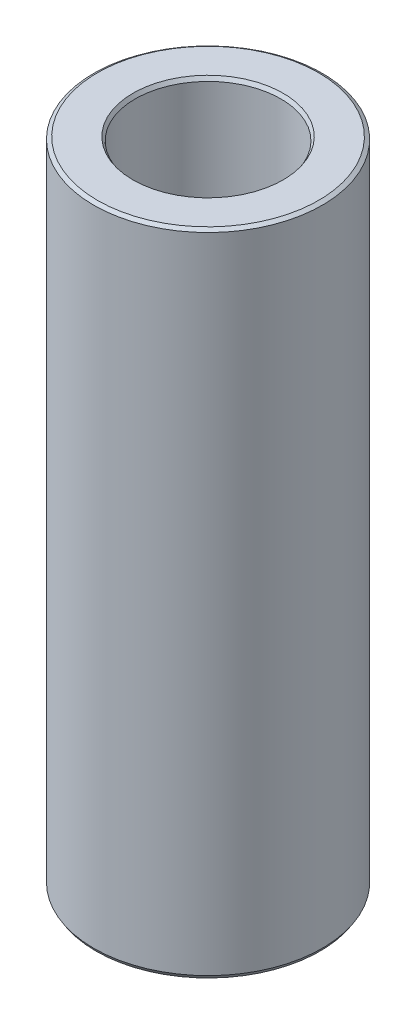
ISO-10303-21;
HEADER;
FILE_DESCRIPTION(('STEP AP214'),'2;1');
FILE_NAME('part.step','',(''),(''),'','','');
FILE_SCHEMA(('AUTOMOTIVE_DESIGN { 1 0 10303 214 1 1 1 1 }'));
ENDSEC;
DATA;
#1=APPLICATION_CONTEXT('core data for automotive mechanical design processes');
#2=APPLICATION_PROTOCOL_DEFINITION('international standard','automotive_design',2000,#1);
#3=PRODUCT_CONTEXT('',#1,'mechanical');
#4=PRODUCT('Part','Part','',(#3));
#5=PRODUCT_RELATED_PRODUCT_CATEGORY('part','',(#4));
#6=PRODUCT_DEFINITION_FORMATION('','',#4);
#7=PRODUCT_DEFINITION_CONTEXT('part definition',#1,'design');
#8=PRODUCT_DEFINITION('design','',#6,#7);
#9=PRODUCT_DEFINITION_SHAPE('','',#8);
#10=(LENGTH_UNIT() NAMED_UNIT(*) SI_UNIT(.MILLI.,.METRE.));
#11=(NAMED_UNIT(*) PLANE_ANGLE_UNIT() SI_UNIT($,.RADIAN.));
#12=(NAMED_UNIT(*) SI_UNIT($,.STERADIAN.) SOLID_ANGLE_UNIT());
#13=UNCERTAINTY_MEASURE_WITH_UNIT(LENGTH_MEASURE(1.E-05),#10,'distance_accuracy_value','');
#14=(GEOMETRIC_REPRESENTATION_CONTEXT(3) GLOBAL_UNCERTAINTY_ASSIGNED_CONTEXT((#13)) GLOBAL_UNIT_ASSIGNED_CONTEXT((#10,
#11,#12)) REPRESENTATION_CONTEXT('',''));
#15=CARTESIAN_POINT('',(0.,0.,0.));
#16=DIRECTION('',(0.,0.,1.));
#17=DIRECTION('',(1.,0.,0.));
#18=AXIS2_PLACEMENT_3D('',#15,#16,#17);
#19=CARTESIAN_POINT('',(0.,127.889407203139,0.));
#20=DIRECTION('',(0.,-1.,0.));
#21=DIRECTION('',(0.,0.,-1.));
#22=AXIS2_PLACEMENT_3D('',#19,#20,#21);
#23=CYLINDRICAL_SURFACE('',#22,22.5);
#24=CARTESIAN_POINT('',(0.,0.729408993619535,0.));
#25=DIRECTION('',(0.,1.,0.));
#26=DIRECTION('',(0.,0.,1.));
#27=AXIS2_PLACEMENT_3D('',#24,#25,#26);
#28=CIRCLE('',#27,22.5);
#29=CARTESIAN_POINT('',(0.,0.729408993619535,22.5));
#30=VERTEX_POINT('',#29);
#31=EDGE_CURVE('E10',#30,#30,#28,.T.);
#32=ORIENTED_EDGE('',*,*,#31,.T.);
#33=EDGE_LOOP('',(#32));
#34=FACE_BOUND('',#33,.T.);
#35=CARTESIAN_POINT('',(0.,127.431217327372,0.));
#36=DIRECTION('',(0.,1.,0.));
#37=DIRECTION('',(0.,0.,1.));
#38=AXIS2_PLACEMENT_3D('',#35,#36,#37);
#39=CIRCLE('',#38,22.5);
#40=CARTESIAN_POINT('',(0.,127.431217327372,22.5));
#41=VERTEX_POINT('',#40);
#42=EDGE_CURVE('E50',#41,#41,#39,.F.);
#43=ORIENTED_EDGE('',*,*,#42,.T.);
#44=EDGE_LOOP('',(#43));
#45=FACE_BOUND('',#44,.T.);
#46=ADVANCED_FACE('F39',(#34,#45),#23,.T.);
#47=CARTESIAN_POINT('',(0.,127.889407203139,0.));
#48=DIRECTION('',(0.,1.,0.));
#49=DIRECTION('',(0.,0.,1.));
#50=AXIS2_PLACEMENT_3D('',#47,#48,#49);
#51=PLANE('',#50);
#52=CARTESIAN_POINT('',(0.,127.889407203139,0.));
#53=DIRECTION('',(0.,1.,0.));
#54=DIRECTION('',(0.,0.,1.));
#55=AXIS2_PLACEMENT_3D('',#52,#53,#54);
#56=CIRCLE('',#55,14.7904141828817);
#57=CARTESIAN_POINT('',(0.,127.889407203139,14.7904141828817));
#58=VERTEX_POINT('',#57);
#59=EDGE_CURVE('E58',#58,#58,#56,.F.);
#60=ORIENTED_EDGE('',*,*,#59,.T.);
#61=EDGE_LOOP('',(#60));
#62=FACE_BOUND('',#61,.T.);
#63=CARTESIAN_POINT('',(0.,127.889407203139,0.));
#64=DIRECTION('',(0.,1.,0.));
#65=DIRECTION('',(0.,0.,1.));
#66=AXIS2_PLACEMENT_3D('',#63,#64,#65);
#67=CIRCLE('',#66,21.7705910063805);
#68=CARTESIAN_POINT('',(0.,127.889407203139,21.7705910063805));
#69=VERTEX_POINT('',#68);
#70=EDGE_CURVE('E61',#69,#69,#67,.T.);
#71=ORIENTED_EDGE('',*,*,#70,.T.);
#72=EDGE_LOOP('',(#71));
#73=FACE_BOUND('',#72,.T.);
#74=ADVANCED_FACE('F88',(#62,#73),#51,.T.);
#75=CARTESIAN_POINT('',(0.,0.,0.));
#76=DIRECTION('',(0.,1.,0.));
#77=DIRECTION('',(0.,0.,1.));
#78=AXIS2_PLACEMENT_3D('',#75,#76,#77);
#79=PLANE('',#78);
#80=CARTESIAN_POINT('',(0.,0.,0.));
#81=DIRECTION('',(0.,1.,0.));
#82=DIRECTION('',(0.,0.,1.));
#83=AXIS2_PLACEMENT_3D('',#80,#81,#82);
#84=CIRCLE('',#83,15.061633300734);
#85=CARTESIAN_POINT('',(0.,0.,15.061633300734));
#86=VERTEX_POINT('',#85);
#87=EDGE_CURVE('E51',#86,#86,#84,.T.);
#88=ORIENTED_EDGE('',*,*,#87,.T.);
#89=EDGE_LOOP('',(#88));
#90=FACE_BOUND('',#89,.T.);
#91=CARTESIAN_POINT('',(0.,0.,0.));
#92=DIRECTION('',(0.,1.,0.));
#93=DIRECTION('',(0.,0.,1.));
#94=AXIS2_PLACEMENT_3D('',#91,#92,#93);
#95=CIRCLE('',#94,22.0418101242327);
#96=CARTESIAN_POINT('',(0.,0.,22.0418101242327));
#97=VERTEX_POINT('',#96);
#98=EDGE_CURVE('E54',#97,#97,#95,.F.);
#99=ORIENTED_EDGE('',*,*,#98,.T.);
#100=EDGE_LOOP('',(#99));
#101=FACE_BOUND('',#100,.T.);
#102=ADVANCED_FACE('F83',(#90,#101),#79,.F.);
#103=CARTESIAN_POINT('',(0.,127.889407203139,0.));
#104=DIRECTION('',(0.,-1.,0.));
#105=DIRECTION('',(0.,0.,-1.));
#106=AXIS2_PLACEMENT_3D('',#103,#104,#105);
#107=CYLINDRICAL_SURFACE('',#106,14.3322243071144);
#108=CARTESIAN_POINT('',(0.,127.15999820952,0.));
#109=DIRECTION('',(0.,1.,0.));
#110=DIRECTION('',(0.,0.,1.));
#111=AXIS2_PLACEMENT_3D('',#108,#109,#110);
#112=CIRCLE('',#111,14.3322243071144);
#113=CARTESIAN_POINT('',(0.,127.15999820952,14.3322243071144));
#114=VERTEX_POINT('',#113);
#115=EDGE_CURVE('E67',#114,#114,#112,.T.);
#116=ORIENTED_EDGE('',*,*,#115,.T.);
#117=EDGE_LOOP('',(#116));
#118=FACE_BOUND('',#117,.T.);
#119=CARTESIAN_POINT('',(0.,0.458189875767234,0.));
#120=DIRECTION('',(0.,1.,0.));
#121=DIRECTION('',(0.,0.,1.));
#122=AXIS2_PLACEMENT_3D('',#119,#120,#121);
#123=CIRCLE('',#122,14.3322243071144);
#124=CARTESIAN_POINT('',(0.,0.458189875767234,14.3322243071144));
#125=VERTEX_POINT('',#124);
#126=EDGE_CURVE('E69',#125,#125,#123,.F.);
#127=ORIENTED_EDGE('',*,*,#126,.T.);
#128=EDGE_LOOP('',(#127));
#129=FACE_BOUND('',#128,.T.);
#130=ADVANCED_FACE('F71',(#118,#129),#107,.F.);
#131=CARTESIAN_POINT('',(0.,127.15999820952,0.));
#132=DIRECTION('',(0.,1.,0.));
#133=DIRECTION('',(0.,0.,1.));
#134=AXIS2_PLACEMENT_3D('',#131,#132,#133);
#135=CONICAL_SURFACE('',#134,14.3322243071144,0.560872697456722);
#136=ORIENTED_EDGE('',*,*,#59,.F.);
#137=EDGE_LOOP('',(#136));
#138=FACE_BOUND('',#137,.T.);
#139=ORIENTED_EDGE('',*,*,#115,.F.);
#140=EDGE_LOOP('',(#139));
#141=FACE_BOUND('',#140,.T.);
#142=ADVANCED_FACE('F77',(#138,#141),#135,.F.);
#143=CARTESIAN_POINT('',(0.,0.,0.));
#144=DIRECTION('',(0.,-1.,0.));
#145=DIRECTION('',(0.,0.,-1.));
#146=AXIS2_PLACEMENT_3D('',#143,#144,#145);
#147=CONICAL_SURFACE('',#146,15.061633300734,1.00992362933819);
#148=ORIENTED_EDGE('',*,*,#126,.F.);
#149=EDGE_LOOP('',(#148));
#150=FACE_BOUND('',#149,.T.);
#151=ORIENTED_EDGE('',*,*,#87,.F.);
#152=EDGE_LOOP('',(#151));
#153=FACE_BOUND('',#152,.T.);
#154=ADVANCED_FACE('F73',(#150,#153),#147,.F.);
#155=CARTESIAN_POINT('',(0.,0.729408993619535,0.));
#156=DIRECTION('',(0.,1.,0.));
#157=DIRECTION('',(0.,0.,1.));
#158=AXIS2_PLACEMENT_3D('',#155,#156,#157);
#159=CONICAL_SURFACE('',#158,22.5,0.560872697456723);
#160=ORIENTED_EDGE('',*,*,#98,.F.);
#161=EDGE_LOOP('',(#160));
#162=FACE_BOUND('',#161,.T.);
#163=ORIENTED_EDGE('',*,*,#31,.F.);
#164=EDGE_LOOP('',(#163));
#165=FACE_BOUND('',#164,.T.);
#166=ADVANCED_FACE('F76',(#162,#165),#159,.T.);
#167=CARTESIAN_POINT('',(0.,127.889407203139,0.));
#168=DIRECTION('',(0.,-1.,0.));
#169=DIRECTION('',(0.,0.,-1.));
#170=AXIS2_PLACEMENT_3D('',#167,#168,#169);
#171=CONICAL_SURFACE('',#170,21.7705910063805,1.00992362933817);
#172=ORIENTED_EDGE('',*,*,#42,.F.);
#173=EDGE_LOOP('',(#172));
#174=FACE_BOUND('',#173,.T.);
#175=ORIENTED_EDGE('',*,*,#70,.F.);
#176=EDGE_LOOP('',(#175));
#177=FACE_BOUND('',#176,.T.);
#178=ADVANCED_FACE('F45',(#174,#177),#171,.T.);
#179=CLOSED_SHELL('',(#46,#74,#102,#130,#142,#154,#166,#178));
#180=MANIFOLD_SOLID_BREP('B2',#179);
#181=ADVANCED_BREP_SHAPE_REPRESENTATION('',(#18,#180),#14);
#182=SHAPE_DEFINITION_REPRESENTATION(#9,#181);
ENDSEC;
END-ISO-10303-21;
